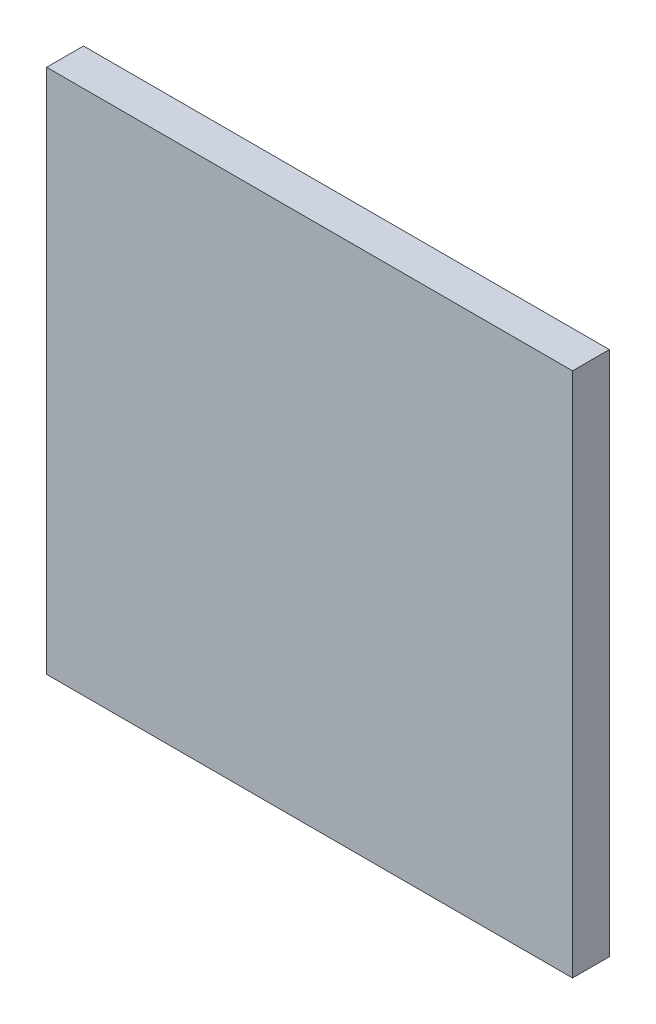
ISO-10303-21;
HEADER;
FILE_DESCRIPTION(('STEP AP214'),'2;1');
FILE_NAME('part.step','',(''),(''),'','','');
FILE_SCHEMA(('AUTOMOTIVE_DESIGN { 1 0 10303 214 1 1 1 1 }'));
ENDSEC;
DATA;
#1=APPLICATION_CONTEXT('core data for automotive mechanical design processes');
#2=APPLICATION_PROTOCOL_DEFINITION('international standard','automotive_design',2000,#1);
#3=PRODUCT_CONTEXT('',#1,'mechanical');
#4=PRODUCT('Part','Part','',(#3));
#5=PRODUCT_RELATED_PRODUCT_CATEGORY('part','',(#4));
#6=PRODUCT_DEFINITION_FORMATION('','',#4);
#7=PRODUCT_DEFINITION_CONTEXT('part definition',#1,'design');
#8=PRODUCT_DEFINITION('design','',#6,#7);
#9=PRODUCT_DEFINITION_SHAPE('','',#8);
#10=(LENGTH_UNIT() NAMED_UNIT(*) SI_UNIT(.MILLI.,.METRE.));
#11=(NAMED_UNIT(*) PLANE_ANGLE_UNIT() SI_UNIT($,.RADIAN.));
#12=(NAMED_UNIT(*) SI_UNIT($,.STERADIAN.) SOLID_ANGLE_UNIT());
#13=UNCERTAINTY_MEASURE_WITH_UNIT(LENGTH_MEASURE(1.E-05),#10,'distance_accuracy_value','');
#14=(GEOMETRIC_REPRESENTATION_CONTEXT(3) GLOBAL_UNCERTAINTY_ASSIGNED_CONTEXT((#13)) GLOBAL_UNIT_ASSIGNED_CONTEXT((#10,
#11,#12)) REPRESENTATION_CONTEXT('',''));
#15=CARTESIAN_POINT('',(0.,0.,0.));
#16=DIRECTION('',(0.,0.,1.));
#17=DIRECTION('',(1.,0.,0.));
#18=AXIS2_PLACEMENT_3D('',#15,#16,#17);
#19=CARTESIAN_POINT('',(25.,25.,3.5));
#20=DIRECTION('',(-1.,0.,0.));
#21=DIRECTION('',(0.,-1.,0.));
#22=AXIS2_PLACEMENT_3D('',#19,#20,#21);
#23=PLANE('',#22);
#24=DIRECTION('',(0.,1.,0.));
#25=VECTOR('',#24,1.);
#26=CARTESIAN_POINT('',(25.,25.,0.));
#27=LINE('',#26,#25);
#28=CARTESIAN_POINT('',(25.,-25.,0.));
#29=VERTEX_POINT('',#28);
#30=CARTESIAN_POINT('',(25.,25.,0.));
#31=VERTEX_POINT('',#30);
#32=EDGE_CURVE('E97',#29,#31,#27,.T.);
#33=ORIENTED_EDGE('',*,*,#32,.T.);
#34=DIRECTION('',(0.,0.,-1.));
#35=VECTOR('',#34,1.);
#36=CARTESIAN_POINT('',(25.,25.,3.5));
#37=LINE('',#36,#35);
#38=CARTESIAN_POINT('',(25.,25.,3.5));
#39=VERTEX_POINT('',#38);
#40=EDGE_CURVE('E11',#39,#31,#37,.T.);
#41=ORIENTED_EDGE('',*,*,#40,.F.);
#42=DIRECTION('',(0.,1.,0.));
#43=VECTOR('',#42,1.);
#44=CARTESIAN_POINT('',(25.,25.,3.5));
#45=LINE('',#44,#43);
#46=CARTESIAN_POINT('',(25.,-25.,3.5));
#47=VERTEX_POINT('',#46);
#48=EDGE_CURVE('E85',#47,#39,#45,.T.);
#49=ORIENTED_EDGE('',*,*,#48,.F.);
#50=DIRECTION('',(0.,0.,-1.));
#51=VECTOR('',#50,1.);
#52=CARTESIAN_POINT('',(25.,-25.,3.5));
#53=LINE('',#52,#51);
#54=EDGE_CURVE('E93',#47,#29,#53,.T.);
#55=ORIENTED_EDGE('',*,*,#54,.T.);
#56=EDGE_LOOP('',(#33,#41,#49,#55));
#57=FACE_BOUND('',#56,.T.);
#58=ADVANCED_FACE('F34',(#57),#23,.F.);
#59=CARTESIAN_POINT('',(-25.,25.,3.5));
#60=DIRECTION('',(0.,-1.,0.));
#61=DIRECTION('',(0.,0.,-1.));
#62=AXIS2_PLACEMENT_3D('',#59,#60,#61);
#63=PLANE('',#62);
#64=DIRECTION('',(-1.,0.,0.));
#65=VECTOR('',#64,1.);
#66=CARTESIAN_POINT('',(-25.,25.,0.));
#67=LINE('',#66,#65);
#68=CARTESIAN_POINT('',(-25.,25.,0.));
#69=VERTEX_POINT('',#68);
#70=EDGE_CURVE('E89',#31,#69,#67,.T.);
#71=ORIENTED_EDGE('',*,*,#70,.T.);
#72=DIRECTION('',(0.,0.,-1.));
#73=VECTOR('',#72,1.);
#74=CARTESIAN_POINT('',(-25.,25.,3.5));
#75=LINE('',#74,#73);
#76=CARTESIAN_POINT('',(-25.,25.,3.5));
#77=VERTEX_POINT('',#76);
#78=EDGE_CURVE('E42',#77,#69,#75,.T.);
#79=ORIENTED_EDGE('',*,*,#78,.F.);
#80=DIRECTION('',(-1.,0.,0.));
#81=VECTOR('',#80,1.);
#82=CARTESIAN_POINT('',(-25.,25.,3.5));
#83=LINE('',#82,#81);
#84=EDGE_CURVE('E80',#39,#77,#83,.T.);
#85=ORIENTED_EDGE('',*,*,#84,.F.);
#86=ORIENTED_EDGE('',*,*,#40,.T.);
#87=EDGE_LOOP('',(#71,#79,#85,#86));
#88=FACE_BOUND('',#87,.T.);
#89=ADVANCED_FACE('F88',(#88),#63,.F.);
#90=CARTESIAN_POINT('',(-25.,25.,3.5));
#91=DIRECTION('',(1.,0.,0.));
#92=DIRECTION('',(0.,1.,0.));
#93=AXIS2_PLACEMENT_3D('',#90,#91,#92);
#94=PLANE('',#93);
#95=DIRECTION('',(0.,-1.,0.));
#96=VECTOR('',#95,1.);
#97=CARTESIAN_POINT('',(-25.,25.,0.));
#98=LINE('',#97,#96);
#99=CARTESIAN_POINT('',(-25.,-25.,0.));
#100=VERTEX_POINT('',#99);
#101=EDGE_CURVE('E67',#69,#100,#98,.T.);
#102=ORIENTED_EDGE('',*,*,#101,.T.);
#103=DIRECTION('',(0.,0.,-1.));
#104=VECTOR('',#103,1.);
#105=CARTESIAN_POINT('',(-25.,-25.,3.5));
#106=LINE('',#105,#104);
#107=CARTESIAN_POINT('',(-25.,-25.,3.5));
#108=VERTEX_POINT('',#107);
#109=EDGE_CURVE('E90',#108,#100,#106,.T.);
#110=ORIENTED_EDGE('',*,*,#109,.F.);
#111=DIRECTION('',(0.,-1.,0.));
#112=VECTOR('',#111,1.);
#113=CARTESIAN_POINT('',(-25.,25.,3.5));
#114=LINE('',#113,#112);
#115=EDGE_CURVE('E83',#77,#108,#114,.T.);
#116=ORIENTED_EDGE('',*,*,#115,.F.);
#117=ORIENTED_EDGE('',*,*,#78,.T.);
#118=EDGE_LOOP('',(#102,#110,#116,#117));
#119=FACE_BOUND('',#118,.T.);
#120=ADVANCED_FACE('F91',(#119),#94,.F.);
#121=CARTESIAN_POINT('',(-25.,-25.,3.5));
#122=DIRECTION('',(0.,1.,0.));
#123=DIRECTION('',(0.,0.,1.));
#124=AXIS2_PLACEMENT_3D('',#121,#122,#123);
#125=PLANE('',#124);
#126=DIRECTION('',(1.,0.,0.));
#127=VECTOR('',#126,1.);
#128=CARTESIAN_POINT('',(-25.,-25.,0.));
#129=LINE('',#128,#127);
#130=EDGE_CURVE('E73',#100,#29,#129,.T.);
#131=ORIENTED_EDGE('',*,*,#130,.T.);
#132=ORIENTED_EDGE('',*,*,#54,.F.);
#133=DIRECTION('',(1.,0.,0.));
#134=VECTOR('',#133,1.);
#135=CARTESIAN_POINT('',(-25.,-25.,3.5));
#136=LINE('',#135,#134);
#137=EDGE_CURVE('E50',#108,#47,#136,.T.);
#138=ORIENTED_EDGE('',*,*,#137,.F.);
#139=ORIENTED_EDGE('',*,*,#109,.T.);
#140=EDGE_LOOP('',(#131,#132,#138,#139));
#141=FACE_BOUND('',#140,.T.);
#142=ADVANCED_FACE('F104',(#141),#125,.F.);
#143=CARTESIAN_POINT('',(0.,0.,3.5));
#144=DIRECTION('',(0.,0.,1.));
#145=DIRECTION('',(1.,0.,0.));
#146=AXIS2_PLACEMENT_3D('',#143,#144,#145);
#147=PLANE('',#146);
#148=ORIENTED_EDGE('',*,*,#48,.T.);
#149=ORIENTED_EDGE('',*,*,#84,.T.);
#150=ORIENTED_EDGE('',*,*,#115,.T.);
#151=ORIENTED_EDGE('',*,*,#137,.T.);
#152=EDGE_LOOP('',(#148,#149,#150,#151));
#153=FACE_BOUND('',#152,.T.);
#154=ADVANCED_FACE('F81',(#153),#147,.T.);
#155=CARTESIAN_POINT('',(0.,0.,0.));
#156=DIRECTION('',(0.,0.,1.));
#157=DIRECTION('',(1.,0.,0.));
#158=AXIS2_PLACEMENT_3D('',#155,#156,#157);
#159=PLANE('',#158);
#160=ORIENTED_EDGE('',*,*,#32,.F.);
#161=ORIENTED_EDGE('',*,*,#130,.F.);
#162=ORIENTED_EDGE('',*,*,#101,.F.);
#163=ORIENTED_EDGE('',*,*,#70,.F.);
#164=EDGE_LOOP('',(#160,#161,#162,#163));
#165=FACE_BOUND('',#164,.T.);
#166=ADVANCED_FACE('F107',(#165),#159,.F.);
#167=CLOSED_SHELL('',(#58,#89,#120,#142,#154,#166));
#168=MANIFOLD_SOLID_BREP('B2',#167);
#169=ADVANCED_BREP_SHAPE_REPRESENTATION('',(#18,#168),#14);
#170=SHAPE_DEFINITION_REPRESENTATION(#9,#169);
ENDSEC;
END-ISO-10303-21;
